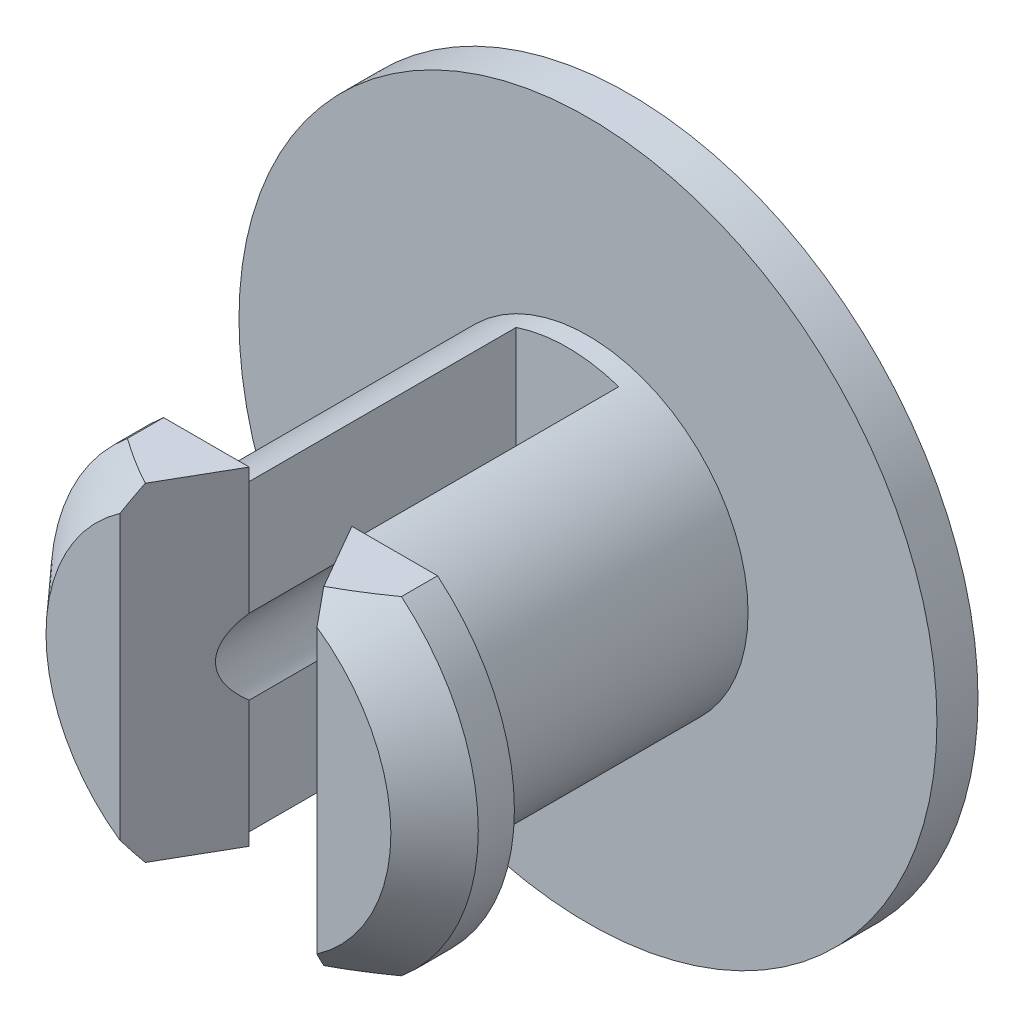
ISO-10303-21;
HEADER;
FILE_DESCRIPTION(('STEP AP214'),'2;1');
FILE_NAME('part.step','',(''),(''),'','','');
FILE_SCHEMA(('AUTOMOTIVE_DESIGN { 1 0 10303 214 1 1 1 1 }'));
ENDSEC;
DATA;
#1=APPLICATION_CONTEXT('core data for automotive mechanical design processes');
#2=APPLICATION_PROTOCOL_DEFINITION('international standard','automotive_design',2000,#1);
#3=PRODUCT_CONTEXT('',#1,'mechanical');
#4=PRODUCT('Part','Part','',(#3));
#5=PRODUCT_RELATED_PRODUCT_CATEGORY('part','',(#4));
#6=PRODUCT_DEFINITION_FORMATION('','',#4);
#7=PRODUCT_DEFINITION_CONTEXT('part definition',#1,'design');
#8=PRODUCT_DEFINITION('design','',#6,#7);
#9=PRODUCT_DEFINITION_SHAPE('','',#8);
#10=(LENGTH_UNIT() NAMED_UNIT(*) SI_UNIT(.MILLI.,.METRE.));
#11=(NAMED_UNIT(*) PLANE_ANGLE_UNIT() SI_UNIT($,.RADIAN.));
#12=(NAMED_UNIT(*) SI_UNIT($,.STERADIAN.) SOLID_ANGLE_UNIT());
#13=UNCERTAINTY_MEASURE_WITH_UNIT(LENGTH_MEASURE(1.E-05),#10,'distance_accuracy_value','');
#14=(GEOMETRIC_REPRESENTATION_CONTEXT(3) GLOBAL_UNCERTAINTY_ASSIGNED_CONTEXT((#13)) GLOBAL_UNIT_ASSIGNED_CONTEXT((#10,
#11,#12)) REPRESENTATION_CONTEXT('',''));
#15=CARTESIAN_POINT('',(0.,0.,0.));
#16=DIRECTION('',(0.,0.,1.));
#17=DIRECTION('',(1.,0.,0.));
#18=AXIS2_PLACEMENT_3D('',#15,#16,#17);
#19=CARTESIAN_POINT('',(-1.25,4.,-3.));
#20=DIRECTION('',(-1.,0.,0.));
#21=DIRECTION('',(0.,-1.,0.));
#22=AXIS2_PLACEMENT_3D('',#19,#20,#21);
#23=PLANE('',#22);
#24=DIRECTION('',(0.,1.,0.));
#25=VECTOR('',#24,1.);
#26=CARTESIAN_POINT('',(-1.25,-6.30705439901186,3.5));
#27=LINE('',#26,#25);
#28=CARTESIAN_POINT('',(-1.25,0.916515138991168,3.5));
#29=VERTEX_POINT('',#28);
#30=CARTESIAN_POINT('',(-1.25,3.69425229241318,3.5));
#31=VERTEX_POINT('',#30);
#32=EDGE_CURVE('E275',#29,#31,#27,.T.);
#33=ORIENTED_EDGE('',*,*,#32,.F.);
#34=DIRECTION('',(0.,0.,-1.));
#35=VECTOR('',#34,1.);
#36=CARTESIAN_POINT('',(-1.25,0.916515138991169,9.88406204335659));
#37=LINE('',#36,#35);
#38=CARTESIAN_POINT('',(-1.25,0.916515138991169,-3.));
#39=VERTEX_POINT('',#38);
#40=EDGE_CURVE('E429',#29,#39,#37,.T.);
#41=ORIENTED_EDGE('',*,*,#40,.T.);
#42=DIRECTION('',(0.,-1.,0.));
#43=VECTOR('',#42,1.);
#44=CARTESIAN_POINT('',(-1.25,4.,-3.));
#45=LINE('',#44,#43);
#46=CARTESIAN_POINT('',(-1.25,3.69425229241318,-3.));
#47=VERTEX_POINT('',#46);
#48=EDGE_CURVE('E368',#47,#39,#45,.T.);
#49=ORIENTED_EDGE('',*,*,#48,.F.);
#50=DIRECTION('',(0.,0.,-1.));
#51=VECTOR('',#50,1.);
#52=CARTESIAN_POINT('',(-1.25,3.69425229241318,3.5));
#53=LINE('',#52,#51);
#54=EDGE_CURVE('E184',#31,#47,#53,.T.);
#55=ORIENTED_EDGE('',*,*,#54,.F.);
#56=EDGE_LOOP('',(#33,#41,#49,#55));
#57=FACE_BOUND('',#56,.T.);
#58=ADVANCED_FACE('F41',(#57),#23,.F.);
#59=CARTESIAN_POINT('',(0.,0.,5.5));
#60=DIRECTION('',(0.,0.,-1.));
#61=DIRECTION('',(-1.,0.,0.));
#62=AXIS2_PLACEMENT_3D('',#59,#60,#61);
#63=PLANE('',#62);
#64=DIRECTION('',(0.,1.,0.));
#65=VECTOR('',#64,1.);
#66=CARTESIAN_POINT('',(-2.4,-6.30705439901186,5.5));
#67=LINE('',#66,#65);
#68=CARTESIAN_POINT('',(-2.4,-3.44673758792282,5.5));
#69=VERTEX_POINT('',#68);
#70=CARTESIAN_POINT('',(-2.4,3.44673758792282,5.5));
#71=VERTEX_POINT('',#70);
#72=EDGE_CURVE('E322',#69,#71,#67,.T.);
#73=ORIENTED_EDGE('',*,*,#72,.T.);
#74=CARTESIAN_POINT('',(0.,0.,5.5));
#75=DIRECTION('',(0.,0.,-1.));
#76=DIRECTION('',(-1.,0.,0.));
#77=AXIS2_PLACEMENT_3D('',#74,#75,#76);
#78=CIRCLE('',#77,4.2);
#79=EDGE_CURVE('E402',#69,#71,#78,.T.);
#80=ORIENTED_EDGE('',*,*,#79,.F.);
#81=EDGE_LOOP('',(#73,#80));
#82=FACE_BOUND('',#81,.T.);
#83=ADVANCED_FACE('F246',(#82),#63,.F.);
#84=CARTESIAN_POINT('',(0.,0.,5.5));
#85=DIRECTION('',(0.,0.,-1.));
#86=DIRECTION('',(-1.,0.,0.));
#87=AXIS2_PLACEMENT_3D('',#84,#85,#86);
#88=CONICAL_SURFACE('',#87,4.2,0.732815101786507);
#89=CARTESIAN_POINT('',(-2.40011499999988,-3.44643816413079,5.50019999999979));
#90=CARTESIAN_POINT('',(-2.38197705622405,-3.49366418864058,5.46865574995486));
#91=CARTESIAN_POINT('',(-2.36365598656422,-3.54060609913571,5.43679302011168));
#92=CARTESIAN_POINT('',(-2.32667562444995,-3.63393615689756,5.37247934686948));
#93=CARTESIAN_POINT('',(-2.30801639740219,-3.68032440843437,5.3400285172212));
#94=CARTESIAN_POINT('',(-2.27038118782431,-3.7725786920145,5.27457597882488));
#95=CARTESIAN_POINT('',(-2.25140521204023,-3.81844473514479,5.24157428180909));
#96=CARTESIAN_POINT('',(-2.21315385255427,-3.90968669535459,5.17505017835525));
#97=CARTESIAN_POINT('',(-2.19387841223797,-3.95506251693865,5.14152767345733));
#98=CARTESIAN_POINT('',(-2.1744657451574,-4.0002,5.10776651331721));
#99=B_SPLINE_CURVE_WITH_KNOTS('',3,(#89,#90,#91,#92,#93,#94,#95,#96,#97,#98),.UNSPECIFIED.,.F.,
.F.,(4,2,2,2,4),(0.,0.1788513948943,0.357668557807178,0.536481917160959,0.715329503172967),.UNSPECIFIED.);
#100=CARTESIAN_POINT('',(-2.1745517609143,-4.,5.10791610593792));
#101=VERTEX_POINT('',#100);
#102=EDGE_CURVE('E168',#69,#101,#99,.T.);
#103=ORIENTED_EDGE('',*,*,#102,.F.);
#104=ORIENTED_EDGE('',*,*,#79,.T.);
#105=CARTESIAN_POINT('',(-2.1744657451574,4.0002,5.10776651331721));
#106=CARTESIAN_POINT('',(-2.19387841223797,3.95506251693865,5.14152767345733));
#107=CARTESIAN_POINT('',(-2.21315385255427,3.90968669535459,5.17505017835525));
#108=CARTESIAN_POINT('',(-2.25140521204023,3.81844473514479,5.24157428180909));
#109=CARTESIAN_POINT('',(-2.27038118782431,3.7725786920145,5.27457597882488));
#110=CARTESIAN_POINT('',(-2.30801639740219,3.68032440843437,5.3400285172212));
#111=CARTESIAN_POINT('',(-2.32667562444995,3.63393615689756,5.37247934686948));
#112=CARTESIAN_POINT('',(-2.36365598656422,3.54060609913571,5.43679302011168));
#113=CARTESIAN_POINT('',(-2.38197705622404,3.49366418864058,5.46865574995486));
#114=CARTESIAN_POINT('',(-2.40011499999988,3.44643816413079,5.50019999999979));
#115=B_SPLINE_CURVE_WITH_KNOTS('',3,(#105,#106,#107,#108,#109,#110,#111,#112,#113,#114),
.UNSPECIFIED.,.F.,.F.,(4,2,2,2,4),(0.,0.178847586012007,0.357660945365787,0.536478108278667,
0.715329503172966),.UNSPECIFIED.);
#116=CARTESIAN_POINT('',(-2.1745517609143,4.,5.10791610593792));
#117=VERTEX_POINT('',#116);
#118=EDGE_CURVE('E387',#117,#71,#115,.T.);
#119=ORIENTED_EDGE('',*,*,#118,.F.);
#120=CARTESIAN_POINT('',(-3.33698090552119,4.,4.37870112249574));
#121=CARTESIAN_POINT('',(-3.26398170782553,4.,4.43065501416276));
#122=CARTESIAN_POINT('',(-3.19051327142506,4.,4.48194851634535));
#123=CARTESIAN_POINT('',(-3.04251732946383,4.,4.58301597414825));
#124=CARTESIAN_POINT('',(-2.96798960905592,4.,4.63278961486987));
#125=CARTESIAN_POINT('',(-2.74210625406947,4.,4.77987556535528));
#126=CARTESIAN_POINT('',(-2.58900841002851,4.,4.87455134631946));
#127=CARTESIAN_POINT('',(-2.27310402878472,4.,5.05697044301415));
#128=CARTESIAN_POINT('',(-2.1101466684409,4.,5.14445502281831));
#129=CARTESIAN_POINT('',(-1.77779951578304,4.,5.30585099799051));
#130=CARTESIAN_POINT('',(-1.60842043842441,4.,5.37978389775886));
#131=CARTESIAN_POINT('',(-1.33072469258482,4.,5.48400953770608));
#132=CARTESIAN_POINT('',(-1.22456162559622,4.,5.52003586507022));
#133=CARTESIAN_POINT('',(-1.00984424490629,4.,5.58421236499116));
#134=CARTESIAN_POINT('',(-0.90128985664412,4.,5.6123622915876));
#135=CARTESIAN_POINT('',(-0.683219694817201,4.,5.65940729987572));
#136=CARTESIAN_POINT('',(-0.573722064841615,4.,5.67838547022299));
#137=CARTESIAN_POINT('',(-0.353466943773829,4.,5.70655815653219));
#138=CARTESIAN_POINT('',(-0.242709572361254,4.,5.71575359416796));
#139=CARTESIAN_POINT('',(-0.0199260925874753,4.,5.72390208699022));
#140=CARTESIAN_POINT('',(0.0921030848196445,4.,5.72277277245057));
#141=CARTESIAN_POINT('',(0.315569255043589,4.,5.71013771504228));
#142=CARTESIAN_POINT('',(0.427006223099913,4.,5.69863154169359));
#143=CARTESIAN_POINT('',(0.648881566848584,4.,5.66578879605219));
#144=CARTESIAN_POINT('',(0.759313770618978,4.,5.64441107826805));
#145=CARTESIAN_POINT('',(0.978078278036964,4.,5.59282818576489));
#146=CARTESIAN_POINT('',(1.08641029116294,4.,5.56262179892745));
#147=CARTESIAN_POINT('',(1.35985844378397,4.,5.47575031728179));
#148=CARTESIAN_POINT('',(1.52325922928956,4.,5.41368962735831));
#149=CARTESIAN_POINT('',(1.8439797561997,4.,5.27546179177775));
#150=CARTESIAN_POINT('',(2.0012942214845,4.,5.19928272430756));
#151=CARTESIAN_POINT('',(2.31054107349161,4.,5.03626185254953));
#152=CARTESIAN_POINT('',(2.46246469875484,4.,4.94940363071426));
#153=CARTESIAN_POINT('',(2.76139738311967,4.,4.76780319507662));
#154=CARTESIAN_POINT('',(2.90840837134693,4.,4.67306412820581));
#155=CARTESIAN_POINT('',(3.10112582160499,4.,4.54313250199063));
#156=CARTESIAN_POINT('',(3.14865840686887,4.,4.51061066092822));
#157=CARTESIAN_POINT('',(3.24318479760022,4.,4.44505017311165));
#158=CARTESIAN_POINT('',(3.29017967528465,4.,4.41201307284152));
#159=CARTESIAN_POINT('',(3.33698090552119,4.,4.37870112249574));
#160=B_SPLINE_CURVE_WITH_KNOTS('',3,(#120,#121,#122,#123,#124,#125,#126,#127,#128,#129,#130,
#131,#132,#133,#134,#135,#136,#137,#138,#139,#140,#141,#142,#143,#144,#145,#146,#147,#148,#149,
#150,#151,#152,#153,#154,#155,#156,#157,#158,#159),.UNSPECIFIED.,.F.,.F.,(4,2,2,2,2,2,2,2,2,2,2,
2,2,2,2,2,2,2,2,4),(0.,0.268791295532795,0.537637908930496,1.07739177773879,1.63183266663063,
2.18538598022074,2.52146430209254,2.85755311768112,3.19053734751833,3.52349020268251,
3.85910162227086,4.19472696521244,4.53176403050401,4.8688473905297,5.39227403433307,
5.91614469970182,6.44083104894405,6.96530888018362,7.13808714417803,7.3104204866621),.UNSPECIFIED.);
#161=CARTESIAN_POINT('',(-3.33628090552119,4.,4.37919933422063));
#162=VERTEX_POINT('',#161);
#163=EDGE_CURVE('E445',#162,#117,#160,.T.);
#164=ORIENTED_EDGE('',*,*,#163,.F.);
#165=CARTESIAN_POINT('',(0.,0.,4.37919933422063));
#166=DIRECTION('',(0.,0.,-1.));
#167=DIRECTION('',(-1.,0.,0.));
#168=AXIS2_PLACEMENT_3D('',#165,#166,#167);
#169=CIRCLE('',#168,5.20872059920143);
#170=CARTESIAN_POINT('',(-3.33628090552119,-4.,4.37919933422063));
#171=VERTEX_POINT('',#170);
#172=EDGE_CURVE('E410',#171,#162,#169,.T.);
#173=ORIENTED_EDGE('',*,*,#172,.F.);
#174=CARTESIAN_POINT('',(3.33698090552119,-4.,4.37870112249574));
#175=CARTESIAN_POINT('',(3.26398170782553,-4.,4.43065501416277));
#176=CARTESIAN_POINT('',(3.19051327142506,-4.,4.48194851634535));
#177=CARTESIAN_POINT('',(3.04251732946383,-4.,4.58301597414825));
#178=CARTESIAN_POINT('',(2.96798960905592,-4.,4.63278961486988));
#179=CARTESIAN_POINT('',(2.74210625406947,-4.,4.77987556535528));
#180=CARTESIAN_POINT('',(2.58900841002851,-4.,4.87455134631946));
#181=CARTESIAN_POINT('',(2.27310402878472,-4.,5.05697044301415));
#182=CARTESIAN_POINT('',(2.1101466684409,-4.,5.14445502281831));
#183=CARTESIAN_POINT('',(1.77779951578304,-4.,5.30585099799051));
#184=CARTESIAN_POINT('',(1.60842043842441,-4.,5.37978389775886));
#185=CARTESIAN_POINT('',(1.33072469258482,-4.,5.48400953770608));
#186=CARTESIAN_POINT('',(1.22456162559622,-4.,5.52003586507022));
#187=CARTESIAN_POINT('',(1.00984424490629,-4.,5.58421236499116));
#188=CARTESIAN_POINT('',(0.901289856644121,-4.,5.6123622915876));
#189=CARTESIAN_POINT('',(0.683219694817201,-4.,5.65940729987572));
#190=CARTESIAN_POINT('',(0.573722064841616,-4.,5.67838547022299));
#191=CARTESIAN_POINT('',(0.35346694377383,-4.,5.70655815653219));
#192=CARTESIAN_POINT('',(0.242709572361254,-4.,5.71575359416796));
#193=CARTESIAN_POINT('',(0.0199260925874755,-4.,5.72390208699022));
#194=CARTESIAN_POINT('',(-0.0921030848196443,-4.,5.72277277245057));
#195=CARTESIAN_POINT('',(-0.315569255043589,-4.,5.71013771504228));
#196=CARTESIAN_POINT('',(-0.427006223099912,-4.,5.69863154169359));
#197=CARTESIAN_POINT('',(-0.648881566848584,-4.,5.66578879605219));
#198=CARTESIAN_POINT('',(-0.759313770618978,-4.,5.64441107826805));
#199=CARTESIAN_POINT('',(-0.978078278036964,-4.,5.59282818576489));
#200=CARTESIAN_POINT('',(-1.08641029116294,-4.,5.56262179892745));
#201=CARTESIAN_POINT('',(-1.35985844378397,-4.,5.47575031728179));
#202=CARTESIAN_POINT('',(-1.52325922928956,-4.,5.41368962735831));
#203=CARTESIAN_POINT('',(-1.8439797561997,-4.,5.27546179177775));
#204=CARTESIAN_POINT('',(-2.0012942214845,-4.,5.19928272430756));
#205=CARTESIAN_POINT('',(-2.31054107349161,-4.,5.03626185254953));
#206=CARTESIAN_POINT('',(-2.46246469875484,-4.,4.94940363071426));
#207=CARTESIAN_POINT('',(-2.76139738311967,-4.,4.76780319507661));
#208=CARTESIAN_POINT('',(-2.90840837134693,-4.,4.67306412820581));
#209=CARTESIAN_POINT('',(-3.10112582160499,-4.,4.54313250199063));
#210=CARTESIAN_POINT('',(-3.14865840686887,-4.,4.51061066092822));
#211=CARTESIAN_POINT('',(-3.24318479760022,-4.,4.44505017311165));
#212=CARTESIAN_POINT('',(-3.29017967528465,-4.,4.41201307284152));
#213=CARTESIAN_POINT('',(-3.33698090552119,-4.,4.37870112249574));
#214=B_SPLINE_CURVE_WITH_KNOTS('',3,(#174,#175,#176,#177,#178,#179,#180,#181,#182,#183,#184,
#185,#186,#187,#188,#189,#190,#191,#192,#193,#194,#195,#196,#197,#198,#199,#200,#201,#202,#203,
#204,#205,#206,#207,#208,#209,#210,#211,#212,#213),.UNSPECIFIED.,.F.,.F.,(4,2,2,2,2,2,2,2,2,2,2,
2,2,2,2,2,2,2,2,4),(0.,0.268791295532795,0.537637908930496,1.07739177773879,1.63183266663063,
2.18538598022074,2.52146430209254,2.85755311768112,3.19053734751832,3.52349020268251,
3.85910162227086,4.19472696521244,4.53176403050401,4.8688473905297,5.39227403433307,
5.91614469970182,6.44083104894405,6.96530888018362,7.13808714417803,7.3104204866621),.UNSPECIFIED.);
#215=EDGE_CURVE('E205',#101,#171,#214,.T.);
#216=ORIENTED_EDGE('',*,*,#215,.F.);
#217=EDGE_LOOP('',(#103,#104,#119,#164,#173,#216));
#218=FACE_BOUND('',#217,.T.);
#219=ADVANCED_FACE('F221',(#218),#88,.T.);
#220=CARTESIAN_POINT('',(0.,-4.,7.));
#221=DIRECTION('',(0.,-1.,0.));
#222=DIRECTION('',(1.,0.,0.));
#223=AXIS2_PLACEMENT_3D('',#220,#221,#222);
#224=PLANE('',#223);
#225=DIRECTION('',(-1.,0.,0.));
#226=VECTOR('',#225,1.);
#227=CARTESIAN_POINT('',(0.,-4.,3.5));
#228=LINE('',#227,#226);
#229=CARTESIAN_POINT('',(-1.25,-4.,3.5));
#230=VERTEX_POINT('',#229);
#231=CARTESIAN_POINT('',(-3.33628090552119,-4.,3.5));
#232=VERTEX_POINT('',#231);
#233=EDGE_CURVE('E179',#230,#232,#228,.T.);
#234=ORIENTED_EDGE('',*,*,#233,.F.);
#235=DIRECTION('',(0.498471124258083,0.,-0.866906303057535));
#236=VECTOR('',#235,1.);
#237=CARTESIAN_POINT('',(-2.4,-4.,5.5));
#238=LINE('',#237,#236);
#239=EDGE_CURVE('E163',#101,#230,#238,.T.);
#240=ORIENTED_EDGE('',*,*,#239,.F.);
#241=ORIENTED_EDGE('',*,*,#215,.T.);
#242=DIRECTION('',(0.,0.,-1.));
#243=VECTOR('',#242,1.);
#244=CARTESIAN_POINT('',(-3.33628090552119,-4.,-5.81491819397509));
#245=LINE('',#244,#243);
#246=EDGE_CURVE('E190',#171,#232,#245,.T.);
#247=ORIENTED_EDGE('',*,*,#246,.T.);
#248=EDGE_LOOP('',(#234,#240,#241,#247));
#249=FACE_BOUND('',#248,.T.);
#250=ADVANCED_FACE('F188',(#249),#224,.T.);
#251=CARTESIAN_POINT('',(0.,4.,7.));
#252=DIRECTION('',(0.,1.,0.));
#253=DIRECTION('',(0.,0.,1.));
#254=AXIS2_PLACEMENT_3D('',#251,#252,#253);
#255=PLANE('',#254);
#256=ORIENTED_EDGE('',*,*,#163,.T.);
#257=DIRECTION('',(0.498471124258083,0.,-0.866906303057535));
#258=VECTOR('',#257,1.);
#259=CARTESIAN_POINT('',(-2.4,4.,5.5));
#260=LINE('',#259,#258);
#261=CARTESIAN_POINT('',(-1.25,4.,3.5));
#262=VERTEX_POINT('',#261);
#263=EDGE_CURVE('E432',#117,#262,#260,.T.);
#264=ORIENTED_EDGE('',*,*,#263,.T.);
#265=DIRECTION('',(1.,0.,0.));
#266=VECTOR('',#265,1.);
#267=CARTESIAN_POINT('',(0.,4.,3.5));
#268=LINE('',#267,#266);
#269=CARTESIAN_POINT('',(-3.33628090552119,4.,3.5));
#270=VERTEX_POINT('',#269);
#271=EDGE_CURVE('E203',#270,#262,#268,.T.);
#272=ORIENTED_EDGE('',*,*,#271,.F.);
#273=DIRECTION('',(0.,0.,-1.));
#274=VECTOR('',#273,1.);
#275=CARTESIAN_POINT('',(-3.33628090552119,4.,-5.81491819397509));
#276=LINE('',#275,#274);
#277=EDGE_CURVE('E421',#270,#162,#276,.F.);
#278=ORIENTED_EDGE('',*,*,#277,.T.);
#279=EDGE_LOOP('',(#256,#264,#272,#278));
#280=FACE_BOUND('',#279,.T.);
#281=ADVANCED_FACE('F227',(#280),#255,.T.);
#282=CARTESIAN_POINT('',(-1.25,-3.69425229241317,3.5));
#283=VERTEX_POINT('',#282);
#284=CARTESIAN_POINT('',(-1.25,-0.916515138991169,3.5));
#285=VERTEX_POINT('',#284);
#286=EDGE_CURVE('E63',#283,#285,#27,.T.);
#287=ORIENTED_EDGE('',*,*,#286,.F.);
#288=DIRECTION('',(0.,0.,-1.));
#289=VECTOR('',#288,1.);
#290=CARTESIAN_POINT('',(-1.25,-3.69425229241318,3.5));
#291=LINE('',#290,#289);
#292=CARTESIAN_POINT('',(-1.25,-3.69425229241318,-3.));
#293=VERTEX_POINT('',#292);
#294=EDGE_CURVE('E185',#293,#283,#291,.F.);
#295=ORIENTED_EDGE('',*,*,#294,.F.);
#296=CARTESIAN_POINT('',(-1.25,-0.916515138991169,-3.));
#297=VERTEX_POINT('',#296);
#298=EDGE_CURVE('E375',#297,#293,#45,.T.);
#299=ORIENTED_EDGE('',*,*,#298,.F.);
#300=DIRECTION('',(0.,0.,-1.));
#301=VECTOR('',#300,1.);
#302=CARTESIAN_POINT('',(-1.25,-0.916515138991169,9.88406204335659));
#303=LINE('',#302,#301);
#304=EDGE_CURVE('E274',#297,#285,#303,.F.);
#305=ORIENTED_EDGE('',*,*,#304,.T.);
#306=EDGE_LOOP('',(#287,#295,#299,#305));
#307=FACE_BOUND('',#306,.T.);
#308=ADVANCED_FACE('F248',(#307),#23,.F.);
#309=CARTESIAN_POINT('',(0.,0.,9.88406204335659));
#310=DIRECTION('',(0.,0.,-1.));
#311=DIRECTION('',(-1.,0.,0.));
#312=AXIS2_PLACEMENT_3D('',#309,#310,#311);
#313=CYLINDRICAL_SURFACE('',#312,1.55);
#314=CARTESIAN_POINT('',(0.,0.,-4.5));
#315=DIRECTION('',(0.,0.,-1.));
#316=DIRECTION('',(-1.,0.,0.));
#317=AXIS2_PLACEMENT_3D('',#314,#315,#316);
#318=CIRCLE('',#317,1.55);
#319=CARTESIAN_POINT('',(-1.55,0.,-4.5));
#320=VERTEX_POINT('',#319);
#321=EDGE_CURVE('E380',#320,#320,#318,.T.);
#322=ORIENTED_EDGE('',*,*,#321,.T.);
#323=EDGE_LOOP('',(#322));
#324=FACE_BOUND('',#323,.T.);
#325=CARTESIAN_POINT('',(0.,0.,1.32608695652174));
#326=DIRECTION('',(0.866906303057535,0.,0.498471124258083));
#327=DIRECTION('',(0.498471124258083,0.,-0.866906303057535));
#328=AXIS2_PLACEMENT_3D('',#325,#326,#327);
#329=ELLIPSE('',#328,3.10950810301599,1.55);
#330=EDGE_CURVE('E11',#285,#29,#329,.F.);
#331=ORIENTED_EDGE('',*,*,#330,.F.);
#332=ORIENTED_EDGE('',*,*,#304,.F.);
#333=CARTESIAN_POINT('',(0.,0.,-3.));
#334=DIRECTION('',(0.,0.,1.));
#335=DIRECTION('',(1.,0.,0.));
#336=AXIS2_PLACEMENT_3D('',#333,#334,#335);
#337=CIRCLE('',#336,1.55);
#338=CARTESIAN_POINT('',(1.25,-0.916515138991166,-3.));
#339=VERTEX_POINT('',#338);
#340=EDGE_CURVE('E374',#297,#339,#337,.T.);
#341=ORIENTED_EDGE('',*,*,#340,.T.);
#342=DIRECTION('',(0.,0.,-1.));
#343=VECTOR('',#342,1.);
#344=CARTESIAN_POINT('',(1.25,-0.916515138991166,9.88406204335659));
#345=LINE('',#344,#343);
#346=CARTESIAN_POINT('',(1.25,-0.916515138991168,3.5));
#347=VERTEX_POINT('',#346);
#348=EDGE_CURVE('E372',#347,#339,#345,.T.);
#349=ORIENTED_EDGE('',*,*,#348,.F.);
#350=CARTESIAN_POINT('',(0.,0.,1.32608695652174));
#351=DIRECTION('',(0.866906303057535,0.,-0.498471124258083));
#352=DIRECTION('',(-0.498471124258083,0.,-0.866906303057535));
#353=AXIS2_PLACEMENT_3D('',#350,#351,#352);
#354=ELLIPSE('',#353,3.10950810301599,1.55);
#355=CARTESIAN_POINT('',(1.25,0.916515138991166,3.5));
#356=VERTEX_POINT('',#355);
#357=EDGE_CURVE('E49',#347,#356,#354,.F.);
#358=ORIENTED_EDGE('',*,*,#357,.T.);
#359=DIRECTION('',(0.,0.,-1.));
#360=VECTOR('',#359,1.);
#361=CARTESIAN_POINT('',(1.25,0.916515138991166,9.88406204335659));
#362=LINE('',#361,#360);
#363=CARTESIAN_POINT('',(1.25,0.916515138991166,-3.));
#364=VERTEX_POINT('',#363);
#365=EDGE_CURVE('E371',#364,#356,#362,.F.);
#366=ORIENTED_EDGE('',*,*,#365,.F.);
#367=EDGE_CURVE('E364',#364,#39,#337,.T.);
#368=ORIENTED_EDGE('',*,*,#367,.T.);
#369=ORIENTED_EDGE('',*,*,#40,.F.);
#370=EDGE_LOOP('',(#331,#332,#341,#349,#358,#366,#368,#369));
#371=FACE_BOUND('',#370,.T.);
#372=ADVANCED_FACE('F258',(#324,#371),#313,.F.);
#373=CARTESIAN_POINT('',(0.,0.,-3.));
#374=DIRECTION('',(0.,0.,1.));
#375=DIRECTION('',(1.,0.,0.));
#376=AXIS2_PLACEMENT_3D('',#373,#374,#375);
#377=PLANE('',#376);
#378=ORIENTED_EDGE('',*,*,#367,.F.);
#379=DIRECTION('',(0.,1.,0.));
#380=VECTOR('',#379,1.);
#381=CARTESIAN_POINT('',(1.25,-4.,-3.));
#382=LINE('',#381,#380);
#383=CARTESIAN_POINT('',(1.25,3.69425229241317,-3.));
#384=VERTEX_POINT('',#383);
#385=EDGE_CURVE('E286',#364,#384,#382,.T.);
#386=ORIENTED_EDGE('',*,*,#385,.T.);
#387=CARTESIAN_POINT('',(0.,0.,-3.));
#388=DIRECTION('',(0.,0.,1.));
#389=DIRECTION('',(1.,0.,0.));
#390=AXIS2_PLACEMENT_3D('',#387,#388,#389);
#391=CIRCLE('',#390,3.9);
#392=EDGE_CURVE('E427',#384,#47,#391,.T.);
#393=ORIENTED_EDGE('',*,*,#392,.T.);
#394=ORIENTED_EDGE('',*,*,#48,.T.);
#395=EDGE_LOOP('',(#378,#386,#393,#394));
#396=FACE_BOUND('',#395,.T.);
#397=ADVANCED_FACE('F264',(#396),#377,.T.);
#398=CARTESIAN_POINT('',(1.25,-4.,-3.));
#399=DIRECTION('',(1.,0.,0.));
#400=DIRECTION('',(0.,0.,-1.));
#401=AXIS2_PLACEMENT_3D('',#398,#399,#400);
#402=PLANE('',#401);
#403=DIRECTION('',(0.,0.,-1.));
#404=VECTOR('',#403,1.);
#405=CARTESIAN_POINT('',(1.25,-3.69425229241317,3.5));
#406=LINE('',#405,#404);
#407=CARTESIAN_POINT('',(1.25,-3.69425229241318,3.5));
#408=VERTEX_POINT('',#407);
#409=CARTESIAN_POINT('',(1.25,-3.69425229241317,-3.));
#410=VERTEX_POINT('',#409);
#411=EDGE_CURVE('E198',#408,#410,#406,.T.);
#412=ORIENTED_EDGE('',*,*,#411,.F.);
#413=DIRECTION('',(0.,1.,0.));
#414=VECTOR('',#413,1.);
#415=CARTESIAN_POINT('',(1.25,-6.30705439901186,3.5));
#416=LINE('',#415,#414);
#417=EDGE_CURVE('E302',#408,#347,#416,.T.);
#418=ORIENTED_EDGE('',*,*,#417,.T.);
#419=ORIENTED_EDGE('',*,*,#348,.T.);
#420=EDGE_CURVE('E283',#410,#339,#382,.T.);
#421=ORIENTED_EDGE('',*,*,#420,.F.);
#422=EDGE_LOOP('',(#412,#418,#419,#421));
#423=FACE_BOUND('',#422,.T.);
#424=ADVANCED_FACE('F301',(#423),#402,.F.);
#425=CARTESIAN_POINT('',(0.,0.,3.5));
#426=DIRECTION('',(0.,0.,1.));
#427=DIRECTION('',(1.,0.,0.));
#428=AXIS2_PLACEMENT_3D('',#425,#426,#427);
#429=PLANE('',#428);
#430=CARTESIAN_POINT('',(3.33628090552119,-4.,3.5));
#431=VERTEX_POINT('',#430);
#432=CARTESIAN_POINT('',(1.25,-4.,3.5));
#433=VERTEX_POINT('',#432);
#434=EDGE_CURVE('E192',#431,#433,#228,.T.);
#435=ORIENTED_EDGE('',*,*,#434,.T.);
#436=DIRECTION('',(0.,1.,0.));
#437=VECTOR('',#436,1.);
#438=CARTESIAN_POINT('',(1.25,0.,3.5));
#439=LINE('',#438,#437);
#440=EDGE_CURVE('E193',#433,#408,#439,.T.);
#441=ORIENTED_EDGE('',*,*,#440,.T.);
#442=CARTESIAN_POINT('',(0.,0.,3.5));
#443=DIRECTION('',(0.,0.,1.));
#444=DIRECTION('',(1.,0.,0.));
#445=AXIS2_PLACEMENT_3D('',#442,#443,#444);
#446=CIRCLE('',#445,3.9);
#447=CARTESIAN_POINT('',(1.25,3.69425229241318,3.5));
#448=VERTEX_POINT('',#447);
#449=EDGE_CURVE('E297',#408,#448,#446,.T.);
#450=ORIENTED_EDGE('',*,*,#449,.T.);
#451=CARTESIAN_POINT('',(1.25,4.,3.5));
#452=VERTEX_POINT('',#451);
#453=EDGE_CURVE('E200',#448,#452,#439,.T.);
#454=ORIENTED_EDGE('',*,*,#453,.T.);
#455=CARTESIAN_POINT('',(3.33628090552119,4.,3.5));
#456=VERTEX_POINT('',#455);
#457=EDGE_CURVE('E196',#452,#456,#268,.T.);
#458=ORIENTED_EDGE('',*,*,#457,.T.);
#459=CARTESIAN_POINT('',(0.,0.,3.5));
#460=DIRECTION('',(0.,0.,-1.));
#461=DIRECTION('',(-1.,0.,0.));
#462=AXIS2_PLACEMENT_3D('',#459,#460,#461);
#463=CIRCLE('',#462,5.20872059920143);
#464=EDGE_CURVE('E444',#456,#431,#463,.T.);
#465=ORIENTED_EDGE('',*,*,#464,.T.);
#466=EDGE_LOOP('',(#435,#441,#450,#454,#458,#465));
#467=FACE_BOUND('',#466,.T.);
#468=ADVANCED_FACE('F305',(#467),#429,.F.);
#469=CARTESIAN_POINT('',(2.4,3.44673758792282,5.5));
#470=VERTEX_POINT('',#469);
#471=CARTESIAN_POINT('',(2.4,-3.44673758792282,5.5));
#472=VERTEX_POINT('',#471);
#473=EDGE_CURVE('E398',#470,#472,#78,.T.);
#474=ORIENTED_EDGE('',*,*,#473,.F.);
#475=DIRECTION('',(0.,1.,0.));
#476=VECTOR('',#475,1.);
#477=CARTESIAN_POINT('',(2.4,-6.30705439901186,5.5));
#478=LINE('',#477,#476);
#479=EDGE_CURVE('E315',#472,#470,#478,.T.);
#480=ORIENTED_EDGE('',*,*,#479,.F.);
#481=EDGE_LOOP('',(#474,#480));
#482=FACE_BOUND('',#481,.T.);
#483=ADVANCED_FACE('F254',(#482),#63,.F.);
#484=DIRECTION('',(-0.498471124258083,0.,-0.866906303057535));
#485=VECTOR('',#484,1.);
#486=CARTESIAN_POINT('',(2.4,-4.,5.5));
#487=LINE('',#486,#485);
#488=CARTESIAN_POINT('',(2.1745517609143,-4.,5.10791610593792));
#489=VERTEX_POINT('',#488);
#490=EDGE_CURVE('E309',#489,#433,#487,.T.);
#491=ORIENTED_EDGE('',*,*,#490,.T.);
#492=ORIENTED_EDGE('',*,*,#434,.F.);
#493=DIRECTION('',(0.,0.,-1.));
#494=VECTOR('',#493,1.);
#495=CARTESIAN_POINT('',(3.33628090552119,-4.,-5.81491819397509));
#496=LINE('',#495,#494);
#497=CARTESIAN_POINT('',(3.33628090552119,-4.,4.37919933422063));
#498=VERTEX_POINT('',#497);
#499=EDGE_CURVE('E418',#431,#498,#496,.F.);
#500=ORIENTED_EDGE('',*,*,#499,.T.);
#501=EDGE_CURVE('E213',#498,#489,#214,.T.);
#502=ORIENTED_EDGE('',*,*,#501,.T.);
#503=EDGE_LOOP('',(#491,#492,#500,#502));
#504=FACE_BOUND('',#503,.T.);
#505=ADVANCED_FACE('F228',(#504),#224,.T.);
#506=DIRECTION('',(-0.498471124258083,0.,-0.866906303057535));
#507=VECTOR('',#506,1.);
#508=CARTESIAN_POINT('',(2.4,4.,5.5));
#509=LINE('',#508,#507);
#510=CARTESIAN_POINT('',(2.1745517609143,4.,5.10791610593792));
#511=VERTEX_POINT('',#510);
#512=EDGE_CURVE('E317',#511,#452,#509,.T.);
#513=ORIENTED_EDGE('',*,*,#512,.F.);
#514=CARTESIAN_POINT('',(3.33628090552119,4.,4.37919933422063));
#515=VERTEX_POINT('',#514);
#516=EDGE_CURVE('E214',#511,#515,#160,.T.);
#517=ORIENTED_EDGE('',*,*,#516,.T.);
#518=DIRECTION('',(0.,0.,-1.));
#519=VECTOR('',#518,1.);
#520=CARTESIAN_POINT('',(3.33628090552119,4.,-5.81491819397509));
#521=LINE('',#520,#519);
#522=EDGE_CURVE('E423',#515,#456,#521,.T.);
#523=ORIENTED_EDGE('',*,*,#522,.T.);
#524=ORIENTED_EDGE('',*,*,#457,.F.);
#525=EDGE_LOOP('',(#513,#517,#523,#524));
#526=FACE_BOUND('',#525,.T.);
#527=ADVANCED_FACE('F268',(#526),#255,.T.);
#528=ORIENTED_EDGE('',*,*,#271,.T.);
#529=DIRECTION('',(0.,-1.,0.));
#530=VECTOR('',#529,1.);
#531=CARTESIAN_POINT('',(-1.25,0.,3.5));
#532=LINE('',#531,#530);
#533=EDGE_CURVE('E187',#262,#31,#532,.T.);
#534=ORIENTED_EDGE('',*,*,#533,.T.);
#535=EDGE_CURVE('E183',#31,#283,#446,.T.);
#536=ORIENTED_EDGE('',*,*,#535,.T.);
#537=EDGE_CURVE('E166',#283,#230,#532,.T.);
#538=ORIENTED_EDGE('',*,*,#537,.T.);
#539=ORIENTED_EDGE('',*,*,#233,.T.);
#540=EDGE_CURVE('E443',#232,#270,#463,.T.);
#541=ORIENTED_EDGE('',*,*,#540,.T.);
#542=EDGE_LOOP('',(#528,#534,#536,#538,#539,#541));
#543=FACE_BOUND('',#542,.T.);
#544=ADVANCED_FACE('F177',(#543),#429,.F.);
#545=ORIENTED_EDGE('',*,*,#473,.T.);
#546=CARTESIAN_POINT('',(2.40011499999988,-3.44643816413079,5.50019999999979));
#547=CARTESIAN_POINT('',(2.38197705622404,-3.49366418864058,5.46865574995486));
#548=CARTESIAN_POINT('',(2.36365598656422,-3.54060609913572,5.43679302011168));
#549=CARTESIAN_POINT('',(2.32667562444995,-3.63393615689756,5.37247934686947));
#550=CARTESIAN_POINT('',(2.30801639740219,-3.68032440843437,5.3400285172212));
#551=CARTESIAN_POINT('',(2.27038118782431,-3.7725786920145,5.27457597882488));
#552=CARTESIAN_POINT('',(2.25140521204023,-3.81844473514479,5.24157428180909));
#553=CARTESIAN_POINT('',(2.21315385255427,-3.90968669535459,5.17505017835525));
#554=CARTESIAN_POINT('',(2.19387841223797,-3.95506251693865,5.14152767345733));
#555=CARTESIAN_POINT('',(2.1744657451574,-4.0002,5.10776651331721));
#556=B_SPLINE_CURVE_WITH_KNOTS('',3,(#546,#547,#548,#549,#550,#551,#552,#553,#554,#555),
.UNSPECIFIED.,.F.,.F.,(4,2,2,2,4),(0.,0.178851394894299,0.357668557807177,0.536481917160957,
0.715329503172963),.UNSPECIFIED.);
#557=EDGE_CURVE('E330',#472,#489,#556,.T.);
#558=ORIENTED_EDGE('',*,*,#557,.T.);
#559=ORIENTED_EDGE('',*,*,#501,.F.);
#560=EDGE_CURVE('E408',#515,#498,#169,.T.);
#561=ORIENTED_EDGE('',*,*,#560,.F.);
#562=ORIENTED_EDGE('',*,*,#516,.F.);
#563=CARTESIAN_POINT('',(2.1744657451574,4.0002,5.10776651331721));
#564=CARTESIAN_POINT('',(2.19387841223797,3.95506251693865,5.14152767345733));
#565=CARTESIAN_POINT('',(2.21315385255427,3.90968669535459,5.17505017835525));
#566=CARTESIAN_POINT('',(2.25140521204023,3.81844473514479,5.24157428180909));
#567=CARTESIAN_POINT('',(2.27038118782431,3.7725786920145,5.27457597882488));
#568=CARTESIAN_POINT('',(2.30801639740219,3.68032440843437,5.3400285172212));
#569=CARTESIAN_POINT('',(2.32667562444995,3.63393615689756,5.37247934686947));
#570=CARTESIAN_POINT('',(2.36365598656422,3.54060609913572,5.43679302011168));
#571=CARTESIAN_POINT('',(2.38197705622404,3.49366418864058,5.46865574995486));
#572=CARTESIAN_POINT('',(2.40011499999988,3.44643816413079,5.50019999999979));
#573=B_SPLINE_CURVE_WITH_KNOTS('',3,(#563,#564,#565,#566,#567,#568,#569,#570,#571,#572),
.UNSPECIFIED.,.F.,.F.,(4,2,2,2,4),(0.,0.178847586012006,0.357660945365786,0.536478108278664,
0.715329503172963),.UNSPECIFIED.);
#574=EDGE_CURVE('E172',#511,#470,#573,.T.);
#575=ORIENTED_EDGE('',*,*,#574,.T.);
#576=EDGE_LOOP('',(#545,#558,#559,#561,#562,#575));
#577=FACE_BOUND('',#576,.T.);
#578=ADVANCED_FACE('F234',(#577),#88,.T.);
#579=CARTESIAN_POINT('',(0.,0.,-5.81491819397509));
#580=DIRECTION('',(0.,0.,-1.));
#581=DIRECTION('',(-1.,0.,0.));
#582=AXIS2_PLACEMENT_3D('',#579,#580,#581);
#583=CYLINDRICAL_SURFACE('',#582,5.20872059920143);
#584=ORIENTED_EDGE('',*,*,#522,.F.);
#585=ORIENTED_EDGE('',*,*,#560,.T.);
#586=ORIENTED_EDGE('',*,*,#499,.F.);
#587=ORIENTED_EDGE('',*,*,#464,.F.);
#588=EDGE_LOOP('',(#584,#585,#586,#587));
#589=FACE_BOUND('',#588,.T.);
#590=ADVANCED_FACE('F231',(#589),#583,.T.);
#591=ORIENTED_EDGE('',*,*,#277,.F.);
#592=ORIENTED_EDGE('',*,*,#540,.F.);
#593=ORIENTED_EDGE('',*,*,#246,.F.);
#594=ORIENTED_EDGE('',*,*,#172,.T.);
#595=EDGE_LOOP('',(#591,#592,#593,#594));
#596=FACE_BOUND('',#595,.T.);
#597=ADVANCED_FACE('F233',(#596),#583,.T.);
#598=CARTESIAN_POINT('',(0.,0.,3.5));
#599=DIRECTION('',(0.,0.,-1.));
#600=DIRECTION('',(-1.,0.,0.));
#601=AXIS2_PLACEMENT_3D('',#598,#599,#600);
#602=CYLINDRICAL_SURFACE('',#601,3.9);
#603=ORIENTED_EDGE('',*,*,#392,.F.);
#604=DIRECTION('',(0.,0.,-1.));
#605=VECTOR('',#604,1.);
#606=CARTESIAN_POINT('',(1.25,3.69425229241317,3.5));
#607=LINE('',#606,#605);
#608=EDGE_CURVE('E291',#384,#448,#607,.F.);
#609=ORIENTED_EDGE('',*,*,#608,.T.);
#610=ORIENTED_EDGE('',*,*,#449,.F.);
#611=ORIENTED_EDGE('',*,*,#411,.T.);
#612=EDGE_CURVE('E282',#293,#410,#391,.T.);
#613=ORIENTED_EDGE('',*,*,#612,.F.);
#614=ORIENTED_EDGE('',*,*,#294,.T.);
#615=ORIENTED_EDGE('',*,*,#535,.F.);
#616=ORIENTED_EDGE('',*,*,#54,.T.);
#617=EDGE_LOOP('',(#603,#609,#610,#611,#613,#614,#615,#616));
#618=FACE_BOUND('',#617,.T.);
#619=CARTESIAN_POINT('',(0.,0.,-3.5));
#620=DIRECTION('',(0.,0.,1.));
#621=DIRECTION('',(1.,0.,0.));
#622=AXIS2_PLACEMENT_3D('',#619,#620,#621);
#623=CIRCLE('',#622,3.9);
#624=CARTESIAN_POINT('',(3.9,0.,-3.5));
#625=VERTEX_POINT('',#624);
#626=EDGE_CURVE('E401',#625,#625,#623,.T.);
#627=ORIENTED_EDGE('',*,*,#626,.T.);
#628=EDGE_LOOP('',(#627));
#629=FACE_BOUND('',#628,.T.);
#630=ADVANCED_FACE('F240',(#618,#629),#602,.T.);
#631=CARTESIAN_POINT('',(0.,0.,-3.5));
#632=DIRECTION('',(0.,0.,1.));
#633=DIRECTION('',(1.,0.,0.));
#634=AXIS2_PLACEMENT_3D('',#631,#632,#633);
#635=PLANE('',#634);
#636=ORIENTED_EDGE('',*,*,#626,.F.);
#637=EDGE_LOOP('',(#636));
#638=FACE_BOUND('',#637,.T.);
#639=CARTESIAN_POINT('',(0.,0.,-3.5));
#640=DIRECTION('',(0.,0.,1.));
#641=DIRECTION('',(1.,0.,0.));
#642=AXIS2_PLACEMENT_3D('',#639,#640,#641);
#643=CIRCLE('',#642,8.5);
#644=CARTESIAN_POINT('',(8.5,0.,-3.5));
#645=VERTEX_POINT('',#644);
#646=EDGE_CURVE('E405',#645,#645,#643,.T.);
#647=ORIENTED_EDGE('',*,*,#646,.T.);
#648=EDGE_LOOP('',(#647));
#649=FACE_BOUND('',#648,.T.);
#650=ADVANCED_FACE('F462',(#638,#649),#635,.T.);
#651=CARTESIAN_POINT('',(0.,0.,-4.5));
#652=DIRECTION('',(0.,0.,1.));
#653=DIRECTION('',(1.,0.,0.));
#654=AXIS2_PLACEMENT_3D('',#651,#652,#653);
#655=PLANE('',#654);
#656=ORIENTED_EDGE('',*,*,#321,.F.);
#657=EDGE_LOOP('',(#656));
#658=FACE_BOUND('',#657,.T.);
#659=CARTESIAN_POINT('',(0.,0.,-4.5));
#660=DIRECTION('',(0.,0.,1.));
#661=DIRECTION('',(1.,0.,0.));
#662=AXIS2_PLACEMENT_3D('',#659,#660,#661);
#663=CIRCLE('',#662,8.5);
#664=CARTESIAN_POINT('',(8.5,0.,-4.5));
#665=VERTEX_POINT('',#664);
#666=EDGE_CURVE('E415',#665,#665,#663,.T.);
#667=ORIENTED_EDGE('',*,*,#666,.F.);
#668=EDGE_LOOP('',(#667));
#669=FACE_BOUND('',#668,.T.);
#670=ADVANCED_FACE('F465',(#658,#669),#655,.F.);
#671=CARTESIAN_POINT('',(0.,0.,-4.5));
#672=DIRECTION('',(0.,0.,1.));
#673=DIRECTION('',(1.,0.,0.));
#674=AXIS2_PLACEMENT_3D('',#671,#672,#673);
#675=CYLINDRICAL_SURFACE('',#674,8.5);
#676=ORIENTED_EDGE('',*,*,#666,.T.);
#677=EDGE_LOOP('',(#676));
#678=FACE_BOUND('',#677,.T.);
#679=ORIENTED_EDGE('',*,*,#646,.F.);
#680=EDGE_LOOP('',(#679));
#681=FACE_BOUND('',#680,.T.);
#682=ADVANCED_FACE('F43',(#678,#681),#675,.T.);
#683=ORIENTED_EDGE('',*,*,#340,.F.);
#684=ORIENTED_EDGE('',*,*,#298,.T.);
#685=ORIENTED_EDGE('',*,*,#612,.T.);
#686=ORIENTED_EDGE('',*,*,#420,.T.);
#687=EDGE_LOOP('',(#683,#684,#685,#686));
#688=FACE_BOUND('',#687,.T.);
#689=ADVANCED_FACE('F343',(#688),#377,.T.);
#690=ORIENTED_EDGE('',*,*,#365,.T.);
#691=EDGE_CURVE('E56',#356,#448,#416,.T.);
#692=ORIENTED_EDGE('',*,*,#691,.T.);
#693=ORIENTED_EDGE('',*,*,#608,.F.);
#694=ORIENTED_EDGE('',*,*,#385,.F.);
#695=EDGE_LOOP('',(#690,#692,#693,#694));
#696=FACE_BOUND('',#695,.T.);
#697=ADVANCED_FACE('F339',(#696),#402,.F.);
#698=CARTESIAN_POINT('',(2.4,-6.30705439901186,5.5));
#699=DIRECTION('',(0.866906303057535,0.,-0.498471124258083));
#700=DIRECTION('',(-0.498471124258083,0.,-0.866906303057535));
#701=AXIS2_PLACEMENT_3D('',#698,#699,#700);
#702=PLANE('',#701);
#703=ORIENTED_EDGE('',*,*,#479,.T.);
#704=ORIENTED_EDGE('',*,*,#574,.F.);
#705=ORIENTED_EDGE('',*,*,#512,.T.);
#706=ORIENTED_EDGE('',*,*,#453,.F.);
#707=ORIENTED_EDGE('',*,*,#691,.F.);
#708=ORIENTED_EDGE('',*,*,#357,.F.);
#709=ORIENTED_EDGE('',*,*,#417,.F.);
#710=ORIENTED_EDGE('',*,*,#440,.F.);
#711=ORIENTED_EDGE('',*,*,#490,.F.);
#712=ORIENTED_EDGE('',*,*,#557,.F.);
#713=EDGE_LOOP('',(#703,#704,#705,#706,#707,#708,#709,#710,#711,#712));
#714=FACE_BOUND('',#713,.T.);
#715=ADVANCED_FACE('F308',(#714),#702,.F.);
#716=CARTESIAN_POINT('',(-2.4,-6.30705439901186,5.5));
#717=DIRECTION('',(0.866906303057535,0.,0.498471124258083));
#718=DIRECTION('',(0.498471124258083,0.,-0.866906303057535));
#719=AXIS2_PLACEMENT_3D('',#716,#717,#718);
#720=PLANE('',#719);
#721=ORIENTED_EDGE('',*,*,#102,.T.);
#722=ORIENTED_EDGE('',*,*,#239,.T.);
#723=ORIENTED_EDGE('',*,*,#537,.F.);
#724=ORIENTED_EDGE('',*,*,#286,.T.);
#725=ORIENTED_EDGE('',*,*,#330,.T.);
#726=ORIENTED_EDGE('',*,*,#32,.T.);
#727=ORIENTED_EDGE('',*,*,#533,.F.);
#728=ORIENTED_EDGE('',*,*,#263,.F.);
#729=ORIENTED_EDGE('',*,*,#118,.T.);
#730=ORIENTED_EDGE('',*,*,#72,.F.);
#731=EDGE_LOOP('',(#721,#722,#723,#724,#725,#726,#727,#728,#729,#730));
#732=FACE_BOUND('',#731,.T.);
#733=ADVANCED_FACE('F165',(#732),#720,.T.);
#734=CLOSED_SHELL('',(#58,#83,#219,#250,#281,#308,#372,#397,#424,#468,#483,#505,#527,#544,#578,
#590,#597,#630,#650,#670,#682,#689,#697,#715,#733));
#735=MANIFOLD_SOLID_BREP('B2',#734);
#736=ADVANCED_BREP_SHAPE_REPRESENTATION('',(#18,#735),#14);
#737=SHAPE_DEFINITION_REPRESENTATION(#9,#736);
ENDSEC;
END-ISO-10303-21;
